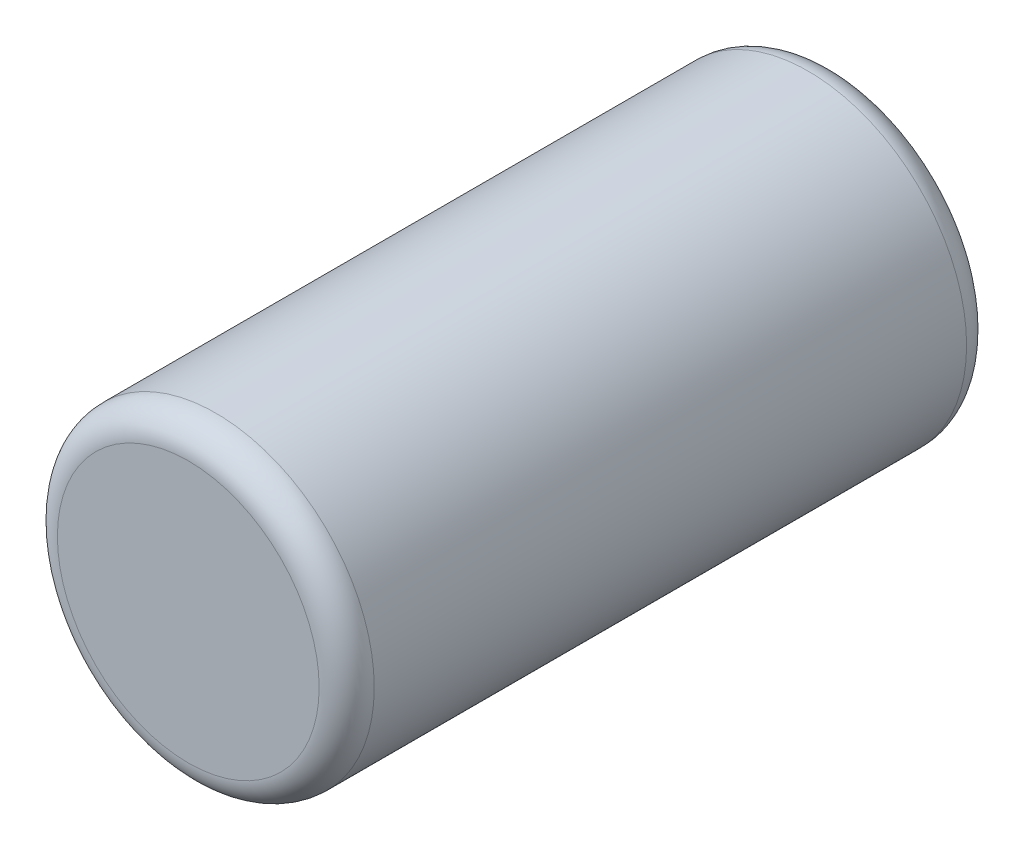
ISO-10303-21;
HEADER;
FILE_DESCRIPTION(('STEP AP214'),'2;1');
FILE_NAME('part.step','',(''),(''),'','','');
FILE_SCHEMA(('AUTOMOTIVE_DESIGN { 1 0 10303 214 1 1 1 1 }'));
ENDSEC;
DATA;
#1=APPLICATION_CONTEXT('core data for automotive mechanical design processes');
#2=APPLICATION_PROTOCOL_DEFINITION('international standard','automotive_design',2000,#1);
#3=PRODUCT_CONTEXT('',#1,'mechanical');
#4=PRODUCT('Part','Part','',(#3));
#5=PRODUCT_RELATED_PRODUCT_CATEGORY('part','',(#4));
#6=PRODUCT_DEFINITION_FORMATION('','',#4);
#7=PRODUCT_DEFINITION_CONTEXT('part definition',#1,'design');
#8=PRODUCT_DEFINITION('design','',#6,#7);
#9=PRODUCT_DEFINITION_SHAPE('','',#8);
#10=(LENGTH_UNIT() NAMED_UNIT(*) SI_UNIT(.MILLI.,.METRE.));
#11=(NAMED_UNIT(*) PLANE_ANGLE_UNIT() SI_UNIT($,.RADIAN.));
#12=(NAMED_UNIT(*) SI_UNIT($,.STERADIAN.) SOLID_ANGLE_UNIT());
#13=UNCERTAINTY_MEASURE_WITH_UNIT(LENGTH_MEASURE(1.E-05),#10,'distance_accuracy_value','');
#14=(GEOMETRIC_REPRESENTATION_CONTEXT(3) GLOBAL_UNCERTAINTY_ASSIGNED_CONTEXT((#13)) GLOBAL_UNIT_ASSIGNED_CONTEXT((#10,
#11,#12)) REPRESENTATION_CONTEXT('',''));
#15=CARTESIAN_POINT('',(0.,0.,0.));
#16=DIRECTION('',(0.,0.,1.));
#17=DIRECTION('',(1.,0.,0.));
#18=AXIS2_PLACEMENT_3D('',#15,#16,#17);
#19=CARTESIAN_POINT('',(0.,0.,11.75));
#20=DIRECTION('',(0.,0.,-1.));
#21=DIRECTION('',(-1.,0.,0.));
#22=AXIS2_PLACEMENT_3D('',#19,#20,#21);
#23=CYLINDRICAL_SURFACE('',#22,5.75);
#24=CARTESIAN_POINT('',(0.,0.,-10.75));
#25=DIRECTION('',(0.,0.,1.));
#26=DIRECTION('',(1.,0.,0.));
#27=AXIS2_PLACEMENT_3D('',#24,#25,#26);
#28=CIRCLE('',#27,5.75);
#29=CARTESIAN_POINT('',(5.75,0.,-10.75));
#30=VERTEX_POINT('',#29);
#31=EDGE_CURVE('E42',#30,#30,#28,.T.);
#32=ORIENTED_EDGE('',*,*,#31,.T.);
#33=EDGE_LOOP('',(#32));
#34=FACE_BOUND('',#33,.T.);
#35=CARTESIAN_POINT('',(0.,0.,10.75));
#36=DIRECTION('',(0.,0.,1.));
#37=DIRECTION('',(1.,0.,0.));
#38=AXIS2_PLACEMENT_3D('',#35,#36,#37);
#39=CIRCLE('',#38,5.75);
#40=CARTESIAN_POINT('',(5.75,0.,10.75));
#41=VERTEX_POINT('',#40);
#42=EDGE_CURVE('E46',#41,#41,#39,.F.);
#43=ORIENTED_EDGE('',*,*,#42,.T.);
#44=EDGE_LOOP('',(#43));
#45=FACE_BOUND('',#44,.T.);
#46=ADVANCED_FACE('F31',(#34,#45),#23,.T.);
#47=CARTESIAN_POINT('',(0.,0.,11.75));
#48=DIRECTION('',(0.,0.,1.));
#49=DIRECTION('',(1.,0.,0.));
#50=AXIS2_PLACEMENT_3D('',#47,#48,#49);
#51=PLANE('',#50);
#52=CARTESIAN_POINT('',(0.,0.,11.75));
#53=DIRECTION('',(0.,0.,1.));
#54=DIRECTION('',(1.,0.,0.));
#55=AXIS2_PLACEMENT_3D('',#52,#53,#54);
#56=CIRCLE('',#55,4.75);
#57=CARTESIAN_POINT('',(4.75,0.,11.75));
#58=VERTEX_POINT('',#57);
#59=EDGE_CURVE('E10',#58,#58,#56,.T.);
#60=ORIENTED_EDGE('',*,*,#59,.T.);
#61=EDGE_LOOP('',(#60));
#62=FACE_BOUND('',#61,.T.);
#63=ADVANCED_FACE('F62',(#62),#51,.T.);
#64=CARTESIAN_POINT('',(0.,0.,-11.75));
#65=DIRECTION('',(0.,0.,1.));
#66=DIRECTION('',(1.,0.,0.));
#67=AXIS2_PLACEMENT_3D('',#64,#65,#66);
#68=PLANE('',#67);
#69=CARTESIAN_POINT('',(0.,0.,-11.75));
#70=DIRECTION('',(0.,0.,1.));
#71=DIRECTION('',(1.,0.,0.));
#72=AXIS2_PLACEMENT_3D('',#69,#70,#71);
#73=CIRCLE('',#72,4.75);
#74=CARTESIAN_POINT('',(4.75,0.,-11.75));
#75=VERTEX_POINT('',#74);
#76=EDGE_CURVE('E38',#75,#75,#73,.F.);
#77=ORIENTED_EDGE('',*,*,#76,.T.);
#78=EDGE_LOOP('',(#77));
#79=FACE_BOUND('',#78,.T.);
#80=ADVANCED_FACE('F59',(#79),#68,.F.);
#81=CARTESIAN_POINT('',(0.,0.,-10.75));
#82=DIRECTION('',(0.,0.,1.));
#83=DIRECTION('',(1.,0.,0.));
#84=AXIS2_PLACEMENT_3D('',#81,#82,#83);
#85=TOROIDAL_SURFACE('',#84,4.75,1.);
#86=ORIENTED_EDGE('',*,*,#76,.F.);
#87=EDGE_LOOP('',(#86));
#88=FACE_BOUND('',#87,.T.);
#89=ORIENTED_EDGE('',*,*,#31,.F.);
#90=EDGE_LOOP('',(#89));
#91=FACE_BOUND('',#90,.T.);
#92=ADVANCED_FACE('F55',(#88,#91),#85,.T.);
#93=CARTESIAN_POINT('',(0.,0.,10.75));
#94=DIRECTION('',(0.,0.,1.));
#95=DIRECTION('',(1.,0.,0.));
#96=AXIS2_PLACEMENT_3D('',#93,#94,#95);
#97=TOROIDAL_SURFACE('',#96,4.75,1.);
#98=ORIENTED_EDGE('',*,*,#42,.F.);
#99=EDGE_LOOP('',(#98));
#100=FACE_BOUND('',#99,.T.);
#101=ORIENTED_EDGE('',*,*,#59,.F.);
#102=EDGE_LOOP('',(#101));
#103=FACE_BOUND('',#102,.T.);
#104=ADVANCED_FACE('F33',(#100,#103),#97,.T.);
#105=CLOSED_SHELL('',(#46,#63,#80,#92,#104));
#106=MANIFOLD_SOLID_BREP('B2',#105);
#107=ADVANCED_BREP_SHAPE_REPRESENTATION('',(#18,#106),#14);
#108=SHAPE_DEFINITION_REPRESENTATION(#9,#107);
ENDSEC;
END-ISO-10303-21;
